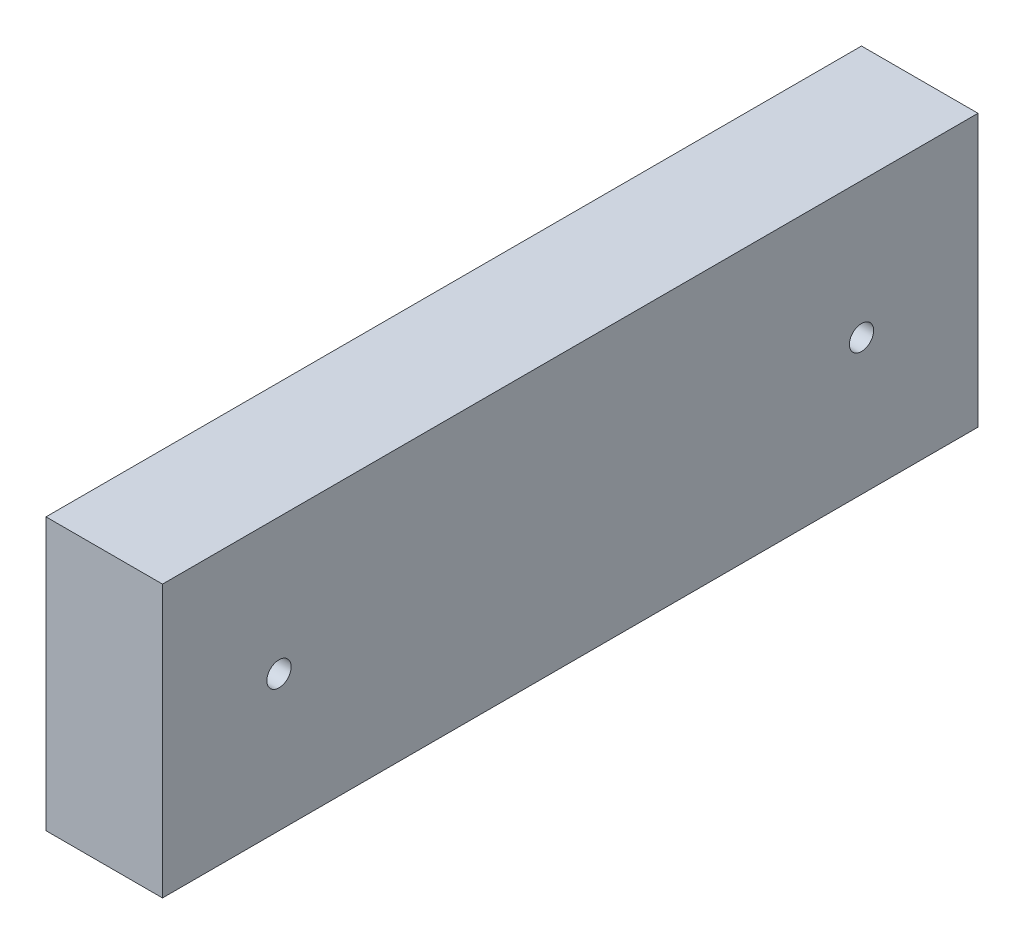
ISO-10303-21;
HEADER;
FILE_DESCRIPTION(('STEP AP214'),'2;1');
FILE_NAME('part.step','',(''),(''),'','','');
FILE_SCHEMA(('AUTOMOTIVE_DESIGN { 1 0 10303 214 1 1 1 1 }'));
ENDSEC;
DATA;
#1=APPLICATION_CONTEXT('core data for automotive mechanical design processes');
#2=APPLICATION_PROTOCOL_DEFINITION('international standard','automotive_design',2000,#1);
#3=PRODUCT_CONTEXT('',#1,'mechanical');
#4=PRODUCT('Part','Part','',(#3));
#5=PRODUCT_RELATED_PRODUCT_CATEGORY('part','',(#4));
#6=PRODUCT_DEFINITION_FORMATION('','',#4);
#7=PRODUCT_DEFINITION_CONTEXT('part definition',#1,'design');
#8=PRODUCT_DEFINITION('design','',#6,#7);
#9=PRODUCT_DEFINITION_SHAPE('','',#8);
#10=(LENGTH_UNIT() NAMED_UNIT(*) SI_UNIT(.MILLI.,.METRE.));
#11=(NAMED_UNIT(*) PLANE_ANGLE_UNIT() SI_UNIT($,.RADIAN.));
#12=(NAMED_UNIT(*) SI_UNIT($,.STERADIAN.) SOLID_ANGLE_UNIT());
#13=UNCERTAINTY_MEASURE_WITH_UNIT(LENGTH_MEASURE(1.E-05),#10,'distance_accuracy_value','');
#14=(GEOMETRIC_REPRESENTATION_CONTEXT(3) GLOBAL_UNCERTAINTY_ASSIGNED_CONTEXT((#13)) GLOBAL_UNIT_ASSIGNED_CONTEXT((#10,
#11,#12)) REPRESENTATION_CONTEXT('',''));
#15=CARTESIAN_POINT('',(0.,0.,0.));
#16=DIRECTION('',(0.,0.,1.));
#17=DIRECTION('',(1.,0.,0.));
#18=AXIS2_PLACEMENT_3D('',#15,#16,#17);
#19=CARTESIAN_POINT('',(19.05,-44.45,266.7));
#20=DIRECTION('',(-1.,0.,0.));
#21=DIRECTION('',(0.,0.,1.));
#22=AXIS2_PLACEMENT_3D('',#19,#20,#21);
#23=PLANE('',#22);
#24=CARTESIAN_POINT('',(19.05,0.,228.6));
#25=DIRECTION('',(1.,0.,0.));
#26=DIRECTION('',(0.,0.,-1.));
#27=AXIS2_PLACEMENT_3D('',#24,#25,#26);
#28=CIRCLE('',#27,3.96875);
#29=CARTESIAN_POINT('',(19.05,0.,224.63125));
#30=VERTEX_POINT('',#29);
#31=EDGE_CURVE('E118',#30,#30,#28,.T.);
#32=ORIENTED_EDGE('',*,*,#31,.F.);
#33=EDGE_LOOP('',(#32));
#34=FACE_BOUND('',#33,.T.);
#35=CARTESIAN_POINT('',(19.05,0.,38.1));
#36=DIRECTION('',(1.,0.,0.));
#37=DIRECTION('',(0.,0.,-1.));
#38=AXIS2_PLACEMENT_3D('',#35,#36,#37);
#39=CIRCLE('',#38,3.96875);
#40=CARTESIAN_POINT('',(19.05,0.,34.13125));
#41=VERTEX_POINT('',#40);
#42=EDGE_CURVE('E112',#41,#41,#39,.T.);
#43=ORIENTED_EDGE('',*,*,#42,.F.);
#44=EDGE_LOOP('',(#43));
#45=FACE_BOUND('',#44,.T.);
#46=DIRECTION('',(0.,1.,0.));
#47=VECTOR('',#46,1.);
#48=CARTESIAN_POINT('',(19.05,-44.45,0.));
#49=LINE('',#48,#47);
#50=CARTESIAN_POINT('',(19.05,-44.45,0.));
#51=VERTEX_POINT('',#50);
#52=CARTESIAN_POINT('',(19.05,44.45,0.));
#53=VERTEX_POINT('',#52);
#54=EDGE_CURVE('E96',#51,#53,#49,.T.);
#55=ORIENTED_EDGE('',*,*,#54,.T.);
#56=DIRECTION('',(0.,0.,-1.));
#57=VECTOR('',#56,1.);
#58=CARTESIAN_POINT('',(19.05,44.45,266.7));
#59=LINE('',#58,#57);
#60=CARTESIAN_POINT('',(19.05,44.45,266.7));
#61=VERTEX_POINT('',#60);
#62=EDGE_CURVE('E11',#61,#53,#59,.T.);
#63=ORIENTED_EDGE('',*,*,#62,.F.);
#64=DIRECTION('',(0.,1.,0.));
#65=VECTOR('',#64,1.);
#66=CARTESIAN_POINT('',(19.05,-44.45,266.7));
#67=LINE('',#66,#65);
#68=CARTESIAN_POINT('',(19.05,-44.45,266.7));
#69=VERTEX_POINT('',#68);
#70=EDGE_CURVE('E84',#69,#61,#67,.T.);
#71=ORIENTED_EDGE('',*,*,#70,.F.);
#72=DIRECTION('',(0.,0.,-1.));
#73=VECTOR('',#72,1.);
#74=CARTESIAN_POINT('',(19.05,-44.45,266.7));
#75=LINE('',#74,#73);
#76=EDGE_CURVE('E92',#69,#51,#75,.T.);
#77=ORIENTED_EDGE('',*,*,#76,.T.);
#78=EDGE_LOOP('',(#55,#63,#71,#77));
#79=FACE_BOUND('',#78,.T.);
#80=ADVANCED_FACE('F33',(#34,#45,#79),#23,.F.);
#81=CARTESIAN_POINT('',(-19.05,44.45,266.7));
#82=DIRECTION('',(0.,-1.,0.));
#83=DIRECTION('',(0.,0.,-1.));
#84=AXIS2_PLACEMENT_3D('',#81,#82,#83);
#85=PLANE('',#84);
#86=DIRECTION('',(-1.,0.,0.));
#87=VECTOR('',#86,1.);
#88=CARTESIAN_POINT('',(-19.05,44.45,0.));
#89=LINE('',#88,#87);
#90=CARTESIAN_POINT('',(-19.05,44.45,0.));
#91=VERTEX_POINT('',#90);
#92=EDGE_CURVE('E88',#53,#91,#89,.T.);
#93=ORIENTED_EDGE('',*,*,#92,.T.);
#94=DIRECTION('',(0.,0.,-1.));
#95=VECTOR('',#94,1.);
#96=CARTESIAN_POINT('',(-19.05,44.45,266.7));
#97=LINE('',#96,#95);
#98=CARTESIAN_POINT('',(-19.05,44.45,266.7));
#99=VERTEX_POINT('',#98);
#100=EDGE_CURVE('E41',#99,#91,#97,.T.);
#101=ORIENTED_EDGE('',*,*,#100,.F.);
#102=DIRECTION('',(-1.,0.,0.));
#103=VECTOR('',#102,1.);
#104=CARTESIAN_POINT('',(-19.05,44.45,266.7));
#105=LINE('',#104,#103);
#106=EDGE_CURVE('E79',#61,#99,#105,.T.);
#107=ORIENTED_EDGE('',*,*,#106,.F.);
#108=ORIENTED_EDGE('',*,*,#62,.T.);
#109=EDGE_LOOP('',(#93,#101,#107,#108));
#110=FACE_BOUND('',#109,.T.);
#111=ADVANCED_FACE('F87',(#110),#85,.F.);
#112=CARTESIAN_POINT('',(-19.05,-44.45,266.7));
#113=DIRECTION('',(1.,0.,0.));
#114=DIRECTION('',(0.,0.,-1.));
#115=AXIS2_PLACEMENT_3D('',#112,#113,#114);
#116=PLANE('',#115);
#117=CARTESIAN_POINT('',(-19.05,0.,228.6));
#118=DIRECTION('',(1.,0.,0.));
#119=DIRECTION('',(0.,0.,-1.));
#120=AXIS2_PLACEMENT_3D('',#117,#118,#119);
#121=CIRCLE('',#120,3.96874999999999);
#122=CARTESIAN_POINT('',(-19.05,0.,224.63125));
#123=VERTEX_POINT('',#122);
#124=EDGE_CURVE('E115',#123,#123,#121,.T.);
#125=ORIENTED_EDGE('',*,*,#124,.T.);
#126=EDGE_LOOP('',(#125));
#127=FACE_BOUND('',#126,.T.);
#128=CARTESIAN_POINT('',(-19.05,0.,38.1));
#129=DIRECTION('',(1.,0.,0.));
#130=DIRECTION('',(0.,0.,-1.));
#131=AXIS2_PLACEMENT_3D('',#128,#129,#130);
#132=CIRCLE('',#131,3.96874999999999);
#133=CARTESIAN_POINT('',(-19.05,0.,34.13125));
#134=VERTEX_POINT('',#133);
#135=EDGE_CURVE('E99',#134,#134,#132,.T.);
#136=ORIENTED_EDGE('',*,*,#135,.T.);
#137=EDGE_LOOP('',(#136));
#138=FACE_BOUND('',#137,.T.);
#139=DIRECTION('',(0.,-1.,0.));
#140=VECTOR('',#139,1.);
#141=CARTESIAN_POINT('',(-19.05,-44.45,0.));
#142=LINE('',#141,#140);
#143=CARTESIAN_POINT('',(-19.05,-44.45,0.));
#144=VERTEX_POINT('',#143);
#145=EDGE_CURVE('E66',#91,#144,#142,.T.);
#146=ORIENTED_EDGE('',*,*,#145,.T.);
#147=DIRECTION('',(0.,0.,-1.));
#148=VECTOR('',#147,1.);
#149=CARTESIAN_POINT('',(-19.05,-44.45,266.7));
#150=LINE('',#149,#148);
#151=CARTESIAN_POINT('',(-19.05,-44.45,266.7));
#152=VERTEX_POINT('',#151);
#153=EDGE_CURVE('E89',#152,#144,#150,.T.);
#154=ORIENTED_EDGE('',*,*,#153,.F.);
#155=DIRECTION('',(0.,-1.,0.));
#156=VECTOR('',#155,1.);
#157=CARTESIAN_POINT('',(-19.05,-44.45,266.7));
#158=LINE('',#157,#156);
#159=EDGE_CURVE('E82',#99,#152,#158,.T.);
#160=ORIENTED_EDGE('',*,*,#159,.F.);
#161=ORIENTED_EDGE('',*,*,#100,.T.);
#162=EDGE_LOOP('',(#146,#154,#160,#161));
#163=FACE_BOUND('',#162,.T.);
#164=ADVANCED_FACE('F90',(#127,#138,#163),#116,.F.);
#165=CARTESIAN_POINT('',(-19.05,-44.45,266.7));
#166=DIRECTION('',(0.,1.,0.));
#167=DIRECTION('',(0.,0.,1.));
#168=AXIS2_PLACEMENT_3D('',#165,#166,#167);
#169=PLANE('',#168);
#170=DIRECTION('',(1.,0.,0.));
#171=VECTOR('',#170,1.);
#172=CARTESIAN_POINT('',(-19.05,-44.45,0.));
#173=LINE('',#172,#171);
#174=EDGE_CURVE('E72',#144,#51,#173,.T.);
#175=ORIENTED_EDGE('',*,*,#174,.T.);
#176=ORIENTED_EDGE('',*,*,#76,.F.);
#177=DIRECTION('',(1.,0.,0.));
#178=VECTOR('',#177,1.);
#179=CARTESIAN_POINT('',(-19.05,-44.45,266.7));
#180=LINE('',#179,#178);
#181=EDGE_CURVE('E49',#152,#69,#180,.T.);
#182=ORIENTED_EDGE('',*,*,#181,.F.);
#183=ORIENTED_EDGE('',*,*,#153,.T.);
#184=EDGE_LOOP('',(#175,#176,#182,#183));
#185=FACE_BOUND('',#184,.T.);
#186=ADVANCED_FACE('F104',(#185),#169,.F.);
#187=CARTESIAN_POINT('',(0.,0.,266.7));
#188=DIRECTION('',(0.,0.,-1.));
#189=DIRECTION('',(-1.,0.,0.));
#190=AXIS2_PLACEMENT_3D('',#187,#188,#189);
#191=PLANE('',#190);
#192=ORIENTED_EDGE('',*,*,#70,.T.);
#193=ORIENTED_EDGE('',*,*,#106,.T.);
#194=ORIENTED_EDGE('',*,*,#159,.T.);
#195=ORIENTED_EDGE('',*,*,#181,.T.);
#196=EDGE_LOOP('',(#192,#193,#194,#195));
#197=FACE_BOUND('',#196,.T.);
#198=ADVANCED_FACE('F80',(#197),#191,.F.);
#199=CARTESIAN_POINT('',(0.,0.,0.));
#200=DIRECTION('',(0.,0.,-1.));
#201=DIRECTION('',(-1.,0.,0.));
#202=AXIS2_PLACEMENT_3D('',#199,#200,#201);
#203=PLANE('',#202);
#204=ORIENTED_EDGE('',*,*,#54,.F.);
#205=ORIENTED_EDGE('',*,*,#174,.F.);
#206=ORIENTED_EDGE('',*,*,#145,.F.);
#207=ORIENTED_EDGE('',*,*,#92,.F.);
#208=EDGE_LOOP('',(#204,#205,#206,#207));
#209=FACE_BOUND('',#208,.T.);
#210=ADVANCED_FACE('F107',(#209),#203,.T.);
#211=CARTESIAN_POINT('',(19.05,0.,38.1));
#212=DIRECTION('',(1.,0.,0.));
#213=DIRECTION('',(0.,0.,-1.));
#214=AXIS2_PLACEMENT_3D('',#211,#212,#213);
#215=CYLINDRICAL_SURFACE('',#214,3.96874999999999);
#216=ORIENTED_EDGE('',*,*,#135,.F.);
#217=EDGE_LOOP('',(#216));
#218=FACE_BOUND('',#217,.T.);
#219=ORIENTED_EDGE('',*,*,#42,.T.);
#220=EDGE_LOOP('',(#219));
#221=FACE_BOUND('',#220,.T.);
#222=ADVANCED_FACE('F128',(#218,#221),#215,.F.);
#223=CARTESIAN_POINT('',(19.05,0.,228.6));
#224=DIRECTION('',(1.,0.,0.));
#225=DIRECTION('',(0.,0.,-1.));
#226=AXIS2_PLACEMENT_3D('',#223,#224,#225);
#227=CYLINDRICAL_SURFACE('',#226,3.96874999999999);
#228=ORIENTED_EDGE('',*,*,#124,.F.);
#229=EDGE_LOOP('',(#228));
#230=FACE_BOUND('',#229,.T.);
#231=ORIENTED_EDGE('',*,*,#31,.T.);
#232=EDGE_LOOP('',(#231));
#233=FACE_BOUND('',#232,.T.);
#234=ADVANCED_FACE('F122',(#230,#233),#227,.F.);
#235=CLOSED_SHELL('',(#80,#111,#164,#186,#198,#210,#222,#234));
#236=MANIFOLD_SOLID_BREP('B2',#235);
#237=ADVANCED_BREP_SHAPE_REPRESENTATION('',(#18,#236),#14);
#238=SHAPE_DEFINITION_REPRESENTATION(#9,#237);
ENDSEC;
END-ISO-10303-21;
